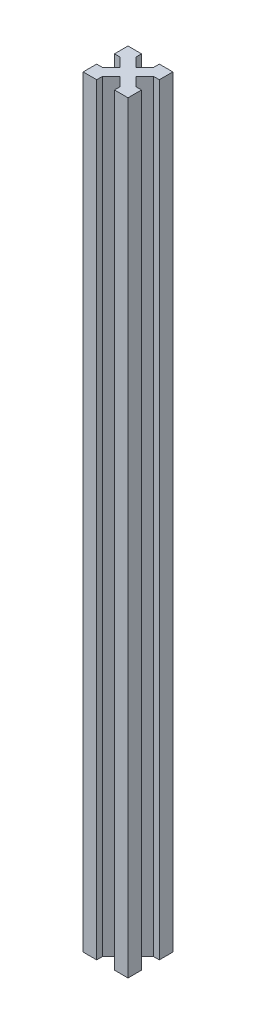
ISO-10303-21;
HEADER;
FILE_DESCRIPTION(('STEP AP214'),'2;1');
FILE_NAME('part.step','',(''),(''),'','','');
FILE_SCHEMA(('AUTOMOTIVE_DESIGN { 1 0 10303 214 1 1 1 1 }'));
ENDSEC;
DATA;
#1=APPLICATION_CONTEXT('core data for automotive mechanical design processes');
#2=APPLICATION_PROTOCOL_DEFINITION('international standard','automotive_design',2000,#1);
#3=PRODUCT_CONTEXT('',#1,'mechanical');
#4=PRODUCT('Part','Part','',(#3));
#5=PRODUCT_RELATED_PRODUCT_CATEGORY('part','',(#4));
#6=PRODUCT_DEFINITION_FORMATION('','',#4);
#7=PRODUCT_DEFINITION_CONTEXT('part definition',#1,'design');
#8=PRODUCT_DEFINITION('design','',#6,#7);
#9=PRODUCT_DEFINITION_SHAPE('','',#8);
#10=(LENGTH_UNIT() NAMED_UNIT(*) SI_UNIT(.MILLI.,.METRE.));
#11=(NAMED_UNIT(*) PLANE_ANGLE_UNIT() SI_UNIT($,.RADIAN.));
#12=(NAMED_UNIT(*) SI_UNIT($,.STERADIAN.) SOLID_ANGLE_UNIT());
#13=UNCERTAINTY_MEASURE_WITH_UNIT(LENGTH_MEASURE(1.E-05),#10,'distance_accuracy_value','');
#14=(GEOMETRIC_REPRESENTATION_CONTEXT(3) GLOBAL_UNCERTAINTY_ASSIGNED_CONTEXT((#13)) GLOBAL_UNIT_ASSIGNED_CONTEXT((#10,
#11,#12)) REPRESENTATION_CONTEXT('',''));
#15=CARTESIAN_POINT('',(0.,0.,0.));
#16=DIRECTION('',(0.,0.,1.));
#17=DIRECTION('',(1.,0.,0.));
#18=AXIS2_PLACEMENT_3D('',#15,#16,#17);
#19=CARTESIAN_POINT('',(-11.7677669529664,340.,-11.7677669529664));
#20=DIRECTION('',(0.707106781186548,0.,0.707106781186547));
#21=DIRECTION('',(0.707106781186547,0.,-0.707106781186548));
#22=AXIS2_PLACEMENT_3D('',#19,#20,#21);
#23=PLANE('',#22);
#24=DIRECTION('',(-0.707106781186547,0.,0.707106781186548));
#25=VECTOR('',#24,1.);
#26=CARTESIAN_POINT('',(-11.7677669529664,0.,-11.7677669529664));
#27=LINE('',#26,#25);
#28=CARTESIAN_POINT('',(-13.5355339059327,0.,-10.));
#29=VERTEX_POINT('',#28);
#30=CARTESIAN_POINT('',(-17.5,0.,-6.03553390593274));
#31=VERTEX_POINT('',#30);
#32=EDGE_CURVE('E226',#29,#31,#27,.T.);
#33=ORIENTED_EDGE('',*,*,#32,.T.);
#34=DIRECTION('',(0.,-1.,0.));
#35=VECTOR('',#34,1.);
#36=CARTESIAN_POINT('',(-17.5,340.,-6.03553390593274));
#37=LINE('',#36,#35);
#38=CARTESIAN_POINT('',(-17.5,340.,-6.03553390593274));
#39=VERTEX_POINT('',#38);
#40=EDGE_CURVE('E11',#39,#31,#37,.T.);
#41=ORIENTED_EDGE('',*,*,#40,.F.);
#42=DIRECTION('',(-0.707106781186547,0.,0.707106781186548));
#43=VECTOR('',#42,1.);
#44=CARTESIAN_POINT('',(-11.7677669529664,340.,-11.7677669529664));
#45=LINE('',#44,#43);
#46=CARTESIAN_POINT('',(-13.5355339059327,340.,-10.));
#47=VERTEX_POINT('',#46);
#48=EDGE_CURVE('E289',#47,#39,#45,.T.);
#49=ORIENTED_EDGE('',*,*,#48,.F.);
#50=DIRECTION('',(0.,-1.,0.));
#51=VECTOR('',#50,1.);
#52=CARTESIAN_POINT('',(-13.5355339059327,340.,-10.));
#53=LINE('',#52,#51);
#54=EDGE_CURVE('E222',#47,#29,#53,.T.);
#55=ORIENTED_EDGE('',*,*,#54,.T.);
#56=EDGE_LOOP('',(#33,#41,#49,#55));
#57=FACE_BOUND('',#56,.T.);
#58=ADVANCED_FACE('F36',(#57),#23,.F.);
#59=CARTESIAN_POINT('',(0.,340.,-6.03553390593273));
#60=DIRECTION('',(0.,0.,1.));
#61=DIRECTION('',(1.,0.,0.));
#62=AXIS2_PLACEMENT_3D('',#59,#60,#61);
#63=PLANE('',#62);
#64=DIRECTION('',(-1.,0.,0.));
#65=VECTOR('',#64,1.);
#66=CARTESIAN_POINT('',(0.,0.,-6.03553390593273));
#67=LINE('',#66,#65);
#68=CARTESIAN_POINT('',(-20.,0.,-6.03553390593273));
#69=VERTEX_POINT('',#68);
#70=EDGE_CURVE('E229',#31,#69,#67,.T.);
#71=ORIENTED_EDGE('',*,*,#70,.T.);
#72=DIRECTION('',(0.,-1.,0.));
#73=VECTOR('',#72,1.);
#74=CARTESIAN_POINT('',(-20.,340.,-6.03553390593273));
#75=LINE('',#74,#73);
#76=CARTESIAN_POINT('',(-20.,340.,-6.03553390593273));
#77=VERTEX_POINT('',#76);
#78=EDGE_CURVE('E44',#77,#69,#75,.T.);
#79=ORIENTED_EDGE('',*,*,#78,.F.);
#80=DIRECTION('',(-1.,0.,0.));
#81=VECTOR('',#80,1.);
#82=CARTESIAN_POINT('',(0.,340.,-6.03553390593273));
#83=LINE('',#82,#81);
#84=EDGE_CURVE('E139',#39,#77,#83,.T.);
#85=ORIENTED_EDGE('',*,*,#84,.F.);
#86=ORIENTED_EDGE('',*,*,#40,.T.);
#87=EDGE_LOOP('',(#71,#79,#85,#86));
#88=FACE_BOUND('',#87,.T.);
#89=ADVANCED_FACE('F338',(#88),#63,.F.);
#90=CARTESIAN_POINT('',(-20.,340.,0.));
#91=DIRECTION('',(-1.,0.,0.));
#92=DIRECTION('',(0.,0.,1.));
#93=AXIS2_PLACEMENT_3D('',#90,#91,#92);
#94=PLANE('',#93);
#95=DIRECTION('',(0.,0.,-1.));
#96=VECTOR('',#95,1.);
#97=CARTESIAN_POINT('',(-20.,0.,0.));
#98=LINE('',#97,#96);
#99=CARTESIAN_POINT('',(-20.,0.,0.));
#100=VERTEX_POINT('',#99);
#101=EDGE_CURVE('E232',#100,#69,#98,.T.);
#102=ORIENTED_EDGE('',*,*,#101,.F.);
#103=DIRECTION('',(0.,-1.,0.));
#104=VECTOR('',#103,1.);
#105=CARTESIAN_POINT('',(-20.,340.,0.));
#106=LINE('',#105,#104);
#107=CARTESIAN_POINT('',(-20.,340.,0.));
#108=VERTEX_POINT('',#107);
#109=EDGE_CURVE('E331',#108,#100,#106,.T.);
#110=ORIENTED_EDGE('',*,*,#109,.F.);
#111=DIRECTION('',(0.,0.,-1.));
#112=VECTOR('',#111,1.);
#113=CARTESIAN_POINT('',(-20.,340.,0.));
#114=LINE('',#113,#112);
#115=EDGE_CURVE('E337',#108,#77,#114,.T.);
#116=ORIENTED_EDGE('',*,*,#115,.T.);
#117=ORIENTED_EDGE('',*,*,#78,.T.);
#118=EDGE_LOOP('',(#102,#110,#116,#117));
#119=FACE_BOUND('',#118,.T.);
#120=ADVANCED_FACE('F335',(#119),#94,.T.);
#121=CARTESIAN_POINT('',(0.,340.,0.));
#122=DIRECTION('',(0.,0.,1.));
#123=DIRECTION('',(1.,0.,0.));
#124=AXIS2_PLACEMENT_3D('',#121,#122,#123);
#125=PLANE('',#124);
#126=DIRECTION('',(-1.,0.,0.));
#127=VECTOR('',#126,1.);
#128=CARTESIAN_POINT('',(0.,0.,0.));
#129=LINE('',#128,#127);
#130=CARTESIAN_POINT('',(-13.9644660940673,0.,0.));
#131=VERTEX_POINT('',#130);
#132=EDGE_CURVE('E235',#131,#100,#129,.T.);
#133=ORIENTED_EDGE('',*,*,#132,.F.);
#134=DIRECTION('',(0.,-1.,0.));
#135=VECTOR('',#134,1.);
#136=CARTESIAN_POINT('',(-13.9644660940673,340.,0.));
#137=LINE('',#136,#135);
#138=CARTESIAN_POINT('',(-13.9644660940673,340.,0.));
#139=VERTEX_POINT('',#138);
#140=EDGE_CURVE('E329',#139,#131,#137,.T.);
#141=ORIENTED_EDGE('',*,*,#140,.F.);
#142=DIRECTION('',(-1.,0.,0.));
#143=VECTOR('',#142,1.);
#144=CARTESIAN_POINT('',(0.,340.,0.));
#145=LINE('',#144,#143);
#146=EDGE_CURVE('E349',#139,#108,#145,.T.);
#147=ORIENTED_EDGE('',*,*,#146,.T.);
#148=ORIENTED_EDGE('',*,*,#109,.T.);
#149=EDGE_LOOP('',(#133,#141,#147,#148));
#150=FACE_BOUND('',#149,.T.);
#151=ADVANCED_FACE('F346',(#150),#125,.T.);
#152=CARTESIAN_POINT('',(-13.9644660940673,340.,0.));
#153=DIRECTION('',(1.,0.,0.));
#154=DIRECTION('',(0.,0.,-1.));
#155=AXIS2_PLACEMENT_3D('',#152,#153,#154);
#156=PLANE('',#155);
#157=DIRECTION('',(0.,0.,1.));
#158=VECTOR('',#157,1.);
#159=CARTESIAN_POINT('',(-13.9644660940673,0.,0.));
#160=LINE('',#159,#158);
#161=CARTESIAN_POINT('',(-13.9644660940673,0.,-2.5));
#162=VERTEX_POINT('',#161);
#163=EDGE_CURVE('E238',#162,#131,#160,.T.);
#164=ORIENTED_EDGE('',*,*,#163,.F.);
#165=DIRECTION('',(0.,-1.,0.));
#166=VECTOR('',#165,1.);
#167=CARTESIAN_POINT('',(-13.9644660940673,340.,-2.5));
#168=LINE('',#167,#166);
#169=CARTESIAN_POINT('',(-13.9644660940673,340.,-2.5));
#170=VERTEX_POINT('',#169);
#171=EDGE_CURVE('E327',#170,#162,#168,.T.);
#172=ORIENTED_EDGE('',*,*,#171,.F.);
#173=DIRECTION('',(0.,0.,1.));
#174=VECTOR('',#173,1.);
#175=CARTESIAN_POINT('',(-13.9644660940673,340.,0.));
#176=LINE('',#175,#174);
#177=EDGE_CURVE('E353',#170,#139,#176,.T.);
#178=ORIENTED_EDGE('',*,*,#177,.T.);
#179=ORIENTED_EDGE('',*,*,#140,.T.);
#180=EDGE_LOOP('',(#164,#172,#178,#179));
#181=FACE_BOUND('',#180,.T.);
#182=ADVANCED_FACE('F427',(#181),#156,.T.);
#183=CARTESIAN_POINT('',(-8.23223304703364,340.,-8.23223304703363));
#184=DIRECTION('',(0.707106781186548,0.,0.707106781186547));
#185=DIRECTION('',(0.707106781186547,0.,-0.707106781186548));
#186=AXIS2_PLACEMENT_3D('',#183,#184,#185);
#187=PLANE('',#186);
#188=DIRECTION('',(-0.707106781186547,0.,0.707106781186548));
#189=VECTOR('',#188,1.);
#190=CARTESIAN_POINT('',(-8.23223304703364,0.,-8.23223304703363));
#191=LINE('',#190,#189);
#192=CARTESIAN_POINT('',(-9.99999999999999,0.,-6.46446609406727));
#193=VERTEX_POINT('',#192);
#194=EDGE_CURVE('E241',#193,#162,#191,.T.);
#195=ORIENTED_EDGE('',*,*,#194,.F.);
#196=DIRECTION('',(0.,-1.,0.));
#197=VECTOR('',#196,1.);
#198=CARTESIAN_POINT('',(-9.99999999999999,340.,-6.46446609406727));
#199=LINE('',#198,#197);
#200=CARTESIAN_POINT('',(-9.99999999999999,340.,-6.46446609406727));
#201=VERTEX_POINT('',#200);
#202=EDGE_CURVE('E325',#201,#193,#199,.T.);
#203=ORIENTED_EDGE('',*,*,#202,.F.);
#204=DIRECTION('',(-0.707106781186547,0.,0.707106781186548));
#205=VECTOR('',#204,1.);
#206=CARTESIAN_POINT('',(-8.23223304703364,340.,-8.23223304703363));
#207=LINE('',#206,#205);
#208=EDGE_CURVE('E359',#201,#170,#207,.T.);
#209=ORIENTED_EDGE('',*,*,#208,.T.);
#210=ORIENTED_EDGE('',*,*,#171,.T.);
#211=EDGE_LOOP('',(#195,#203,#209,#210));
#212=FACE_BOUND('',#211,.T.);
#213=ADVANCED_FACE('F430',(#212),#187,.T.);
#214=CARTESIAN_POINT('',(-1.76776695296636,340.,1.76776695296636));
#215=DIRECTION('',(0.707106781186547,0.,-0.707106781186547));
#216=DIRECTION('',(-0.707106781186548,0.,-0.707106781186548));
#217=AXIS2_PLACEMENT_3D('',#214,#215,#216);
#218=PLANE('',#217);
#219=DIRECTION('',(0.707106781186548,0.,0.707106781186548));
#220=VECTOR('',#219,1.);
#221=CARTESIAN_POINT('',(-1.76776695296636,0.,1.76776695296636));
#222=LINE('',#221,#220);
#223=CARTESIAN_POINT('',(-6.03553390593273,0.,-2.5));
#224=VERTEX_POINT('',#223);
#225=EDGE_CURVE('E244',#193,#224,#222,.T.);
#226=ORIENTED_EDGE('',*,*,#225,.T.);
#227=DIRECTION('',(0.,-1.,0.));
#228=VECTOR('',#227,1.);
#229=CARTESIAN_POINT('',(-6.03553390593273,340.,-2.5));
#230=LINE('',#229,#228);
#231=CARTESIAN_POINT('',(-6.03553390593273,340.,-2.5));
#232=VERTEX_POINT('',#231);
#233=EDGE_CURVE('E322',#232,#224,#230,.T.);
#234=ORIENTED_EDGE('',*,*,#233,.F.);
#235=DIRECTION('',(0.707106781186548,0.,0.707106781186548));
#236=VECTOR('',#235,1.);
#237=CARTESIAN_POINT('',(-1.76776695296636,340.,1.76776695296636));
#238=LINE('',#237,#236);
#239=EDGE_CURVE('E362',#201,#232,#238,.T.);
#240=ORIENTED_EDGE('',*,*,#239,.F.);
#241=ORIENTED_EDGE('',*,*,#202,.T.);
#242=EDGE_LOOP('',(#226,#234,#240,#241));
#243=FACE_BOUND('',#242,.T.);
#244=ADVANCED_FACE('F434',(#243),#218,.F.);
#245=CARTESIAN_POINT('',(-6.03553390593273,340.,0.));
#246=DIRECTION('',(1.,0.,0.));
#247=DIRECTION('',(0.,0.,-1.));
#248=AXIS2_PLACEMENT_3D('',#245,#246,#247);
#249=PLANE('',#248);
#250=DIRECTION('',(0.,0.,1.));
#251=VECTOR('',#250,1.);
#252=CARTESIAN_POINT('',(-6.03553390593273,0.,0.));
#253=LINE('',#252,#251);
#254=CARTESIAN_POINT('',(-6.03553390593273,0.,0.));
#255=VERTEX_POINT('',#254);
#256=EDGE_CURVE('E246',#224,#255,#253,.T.);
#257=ORIENTED_EDGE('',*,*,#256,.T.);
#258=DIRECTION('',(0.,-1.,0.));
#259=VECTOR('',#258,1.);
#260=CARTESIAN_POINT('',(-6.03553390593273,340.,0.));
#261=LINE('',#260,#259);
#262=CARTESIAN_POINT('',(-6.03553390593273,340.,0.));
#263=VERTEX_POINT('',#262);
#264=EDGE_CURVE('E320',#263,#255,#261,.T.);
#265=ORIENTED_EDGE('',*,*,#264,.F.);
#266=DIRECTION('',(0.,0.,1.));
#267=VECTOR('',#266,1.);
#268=CARTESIAN_POINT('',(-6.03553390593273,340.,0.));
#269=LINE('',#268,#267);
#270=EDGE_CURVE('E364',#232,#263,#269,.T.);
#271=ORIENTED_EDGE('',*,*,#270,.F.);
#272=ORIENTED_EDGE('',*,*,#233,.T.);
#273=EDGE_LOOP('',(#257,#265,#271,#272));
#274=FACE_BOUND('',#273,.T.);
#275=ADVANCED_FACE('F438',(#274),#249,.F.);
#276=CARTESIAN_POINT('',(0.,340.,0.));
#277=DIRECTION('',(0.,0.,1.));
#278=DIRECTION('',(1.,0.,0.));
#279=AXIS2_PLACEMENT_3D('',#276,#277,#278);
#280=PLANE('',#279);
#281=DIRECTION('',(-1.,0.,0.));
#282=VECTOR('',#281,1.);
#283=CARTESIAN_POINT('',(0.,0.,0.));
#284=LINE('',#283,#282);
#285=CARTESIAN_POINT('',(0.,0.,0.));
#286=VERTEX_POINT('',#285);
#287=EDGE_CURVE('E249',#286,#255,#284,.T.);
#288=ORIENTED_EDGE('',*,*,#287,.F.);
#289=DIRECTION('',(0.,-1.,0.));
#290=VECTOR('',#289,1.);
#291=CARTESIAN_POINT('',(0.,340.,0.));
#292=LINE('',#291,#290);
#293=CARTESIAN_POINT('',(0.,340.,0.));
#294=VERTEX_POINT('',#293);
#295=EDGE_CURVE('E318',#294,#286,#292,.T.);
#296=ORIENTED_EDGE('',*,*,#295,.F.);
#297=DIRECTION('',(-1.,0.,0.));
#298=VECTOR('',#297,1.);
#299=CARTESIAN_POINT('',(0.,340.,0.));
#300=LINE('',#299,#298);
#301=EDGE_CURVE('E366',#294,#263,#300,.T.);
#302=ORIENTED_EDGE('',*,*,#301,.T.);
#303=ORIENTED_EDGE('',*,*,#264,.T.);
#304=EDGE_LOOP('',(#288,#296,#302,#303));
#305=FACE_BOUND('',#304,.T.);
#306=ADVANCED_FACE('F442',(#305),#280,.T.);
#307=CARTESIAN_POINT('',(0.,340.,0.));
#308=DIRECTION('',(-1.,0.,0.));
#309=DIRECTION('',(0.,0.,1.));
#310=AXIS2_PLACEMENT_3D('',#307,#308,#309);
#311=PLANE('',#310);
#312=DIRECTION('',(0.,0.,-1.));
#313=VECTOR('',#312,1.);
#314=CARTESIAN_POINT('',(0.,0.,0.));
#315=LINE('',#314,#313);
#316=CARTESIAN_POINT('',(0.,0.,-6.03553390593273));
#317=VERTEX_POINT('',#316);
#318=EDGE_CURVE('E252',#286,#317,#315,.T.);
#319=ORIENTED_EDGE('',*,*,#318,.T.);
#320=DIRECTION('',(0.,-1.,0.));
#321=VECTOR('',#320,1.);
#322=CARTESIAN_POINT('',(0.,340.,-6.03553390593273));
#323=LINE('',#322,#321);
#324=CARTESIAN_POINT('',(0.,340.,-6.03553390593273));
#325=VERTEX_POINT('',#324);
#326=EDGE_CURVE('E316',#325,#317,#323,.T.);
#327=ORIENTED_EDGE('',*,*,#326,.F.);
#328=DIRECTION('',(0.,0.,-1.));
#329=VECTOR('',#328,1.);
#330=CARTESIAN_POINT('',(0.,340.,0.));
#331=LINE('',#330,#329);
#332=EDGE_CURVE('E369',#294,#325,#331,.T.);
#333=ORIENTED_EDGE('',*,*,#332,.F.);
#334=ORIENTED_EDGE('',*,*,#295,.T.);
#335=EDGE_LOOP('',(#319,#327,#333,#334));
#336=FACE_BOUND('',#335,.T.);
#337=ADVANCED_FACE('F446',(#336),#311,.F.);
#338=CARTESIAN_POINT('',(0.,340.,-6.03553390593273));
#339=DIRECTION('',(0.,0.,-1.));
#340=DIRECTION('',(-1.,0.,0.));
#341=AXIS2_PLACEMENT_3D('',#338,#339,#340);
#342=PLANE('',#341);
#343=DIRECTION('',(1.,0.,0.));
#344=VECTOR('',#343,1.);
#345=CARTESIAN_POINT('',(0.,0.,-6.03553390593273));
#346=LINE('',#345,#344);
#347=CARTESIAN_POINT('',(-2.5,0.,-6.03553390593274));
#348=VERTEX_POINT('',#347);
#349=EDGE_CURVE('E255',#348,#317,#346,.T.);
#350=ORIENTED_EDGE('',*,*,#349,.F.);
#351=DIRECTION('',(0.,-1.,0.));
#352=VECTOR('',#351,1.);
#353=CARTESIAN_POINT('',(-2.5,340.,-6.03553390593274));
#354=LINE('',#353,#352);
#355=CARTESIAN_POINT('',(-2.5,340.,-6.03553390593274));
#356=VERTEX_POINT('',#355);
#357=EDGE_CURVE('E314',#356,#348,#354,.T.);
#358=ORIENTED_EDGE('',*,*,#357,.F.);
#359=DIRECTION('',(1.,0.,0.));
#360=VECTOR('',#359,1.);
#361=CARTESIAN_POINT('',(0.,340.,-6.03553390593273));
#362=LINE('',#361,#360);
#363=EDGE_CURVE('E371',#356,#325,#362,.T.);
#364=ORIENTED_EDGE('',*,*,#363,.T.);
#365=ORIENTED_EDGE('',*,*,#326,.T.);
#366=EDGE_LOOP('',(#350,#358,#364,#365));
#367=FACE_BOUND('',#366,.T.);
#368=ADVANCED_FACE('F450',(#367),#342,.T.);
#369=CARTESIAN_POINT('',(1.76776695296637,340.,-1.76776695296637));
#370=DIRECTION('',(0.707106781186547,0.,-0.707106781186547));
#371=DIRECTION('',(-0.707106781186548,0.,-0.707106781186548));
#372=AXIS2_PLACEMENT_3D('',#369,#370,#371);
#373=PLANE('',#372);
#374=DIRECTION('',(0.707106781186548,0.,0.707106781186548));
#375=VECTOR('',#374,1.);
#376=CARTESIAN_POINT('',(1.76776695296637,0.,-1.76776695296637));
#377=LINE('',#376,#375);
#378=CARTESIAN_POINT('',(-6.46446609406727,0.,-10.));
#379=VERTEX_POINT('',#378);
#380=EDGE_CURVE('E258',#379,#348,#377,.T.);
#381=ORIENTED_EDGE('',*,*,#380,.F.);
#382=DIRECTION('',(0.,-1.,0.));
#383=VECTOR('',#382,1.);
#384=CARTESIAN_POINT('',(-6.46446609406727,340.,-10.));
#385=LINE('',#384,#383);
#386=CARTESIAN_POINT('',(-6.46446609406727,340.,-10.));
#387=VERTEX_POINT('',#386);
#388=EDGE_CURVE('E312',#387,#379,#385,.T.);
#389=ORIENTED_EDGE('',*,*,#388,.F.);
#390=DIRECTION('',(0.707106781186548,0.,0.707106781186548));
#391=VECTOR('',#390,1.);
#392=CARTESIAN_POINT('',(1.76776695296637,340.,-1.76776695296637));
#393=LINE('',#392,#391);
#394=EDGE_CURVE('E374',#387,#356,#393,.T.);
#395=ORIENTED_EDGE('',*,*,#394,.T.);
#396=ORIENTED_EDGE('',*,*,#357,.T.);
#397=EDGE_LOOP('',(#381,#389,#395,#396));
#398=FACE_BOUND('',#397,.T.);
#399=ADVANCED_FACE('F454',(#398),#373,.T.);
#400=CARTESIAN_POINT('',(-8.23223304703364,340.,-8.23223304703363));
#401=DIRECTION('',(0.707106781186548,0.,0.707106781186547));
#402=DIRECTION('',(0.707106781186547,0.,-0.707106781186548));
#403=AXIS2_PLACEMENT_3D('',#400,#401,#402);
#404=PLANE('',#403);
#405=DIRECTION('',(-0.707106781186547,0.,0.707106781186548));
#406=VECTOR('',#405,1.);
#407=CARTESIAN_POINT('',(-8.23223304703364,0.,-8.23223304703363));
#408=LINE('',#407,#406);
#409=CARTESIAN_POINT('',(-2.50000000000001,0.,-13.9644660940673));
#410=VERTEX_POINT('',#409);
#411=EDGE_CURVE('E261',#410,#379,#408,.T.);
#412=ORIENTED_EDGE('',*,*,#411,.F.);
#413=DIRECTION('',(0.,-1.,0.));
#414=VECTOR('',#413,1.);
#415=CARTESIAN_POINT('',(-2.50000000000001,340.,-13.9644660940673));
#416=LINE('',#415,#414);
#417=CARTESIAN_POINT('',(-2.50000000000001,340.,-13.9644660940673));
#418=VERTEX_POINT('',#417);
#419=EDGE_CURVE('E310',#418,#410,#416,.T.);
#420=ORIENTED_EDGE('',*,*,#419,.F.);
#421=DIRECTION('',(-0.707106781186547,0.,0.707106781186548));
#422=VECTOR('',#421,1.);
#423=CARTESIAN_POINT('',(-8.23223304703364,340.,-8.23223304703363));
#424=LINE('',#423,#422);
#425=EDGE_CURVE('E377',#418,#387,#424,.T.);
#426=ORIENTED_EDGE('',*,*,#425,.T.);
#427=ORIENTED_EDGE('',*,*,#388,.T.);
#428=EDGE_LOOP('',(#412,#420,#426,#427));
#429=FACE_BOUND('',#428,.T.);
#430=ADVANCED_FACE('F458',(#429),#404,.T.);
#431=CARTESIAN_POINT('',(0.,340.,-13.9644660940673));
#432=DIRECTION('',(0.,0.,-1.));
#433=DIRECTION('',(-1.,0.,0.));
#434=AXIS2_PLACEMENT_3D('',#431,#432,#433);
#435=PLANE('',#434);
#436=DIRECTION('',(1.,0.,0.));
#437=VECTOR('',#436,1.);
#438=CARTESIAN_POINT('',(0.,0.,-13.9644660940673));
#439=LINE('',#438,#437);
#440=CARTESIAN_POINT('',(0.,0.,-13.9644660940673));
#441=VERTEX_POINT('',#440);
#442=EDGE_CURVE('E264',#410,#441,#439,.T.);
#443=ORIENTED_EDGE('',*,*,#442,.T.);
#444=DIRECTION('',(0.,-1.,0.));
#445=VECTOR('',#444,1.);
#446=CARTESIAN_POINT('',(0.,340.,-13.9644660940673));
#447=LINE('',#446,#445);
#448=CARTESIAN_POINT('',(0.,340.,-13.9644660940673));
#449=VERTEX_POINT('',#448);
#450=EDGE_CURVE('E307',#449,#441,#447,.T.);
#451=ORIENTED_EDGE('',*,*,#450,.F.);
#452=DIRECTION('',(1.,0.,0.));
#453=VECTOR('',#452,1.);
#454=CARTESIAN_POINT('',(0.,340.,-13.9644660940673));
#455=LINE('',#454,#453);
#456=EDGE_CURVE('E380',#418,#449,#455,.T.);
#457=ORIENTED_EDGE('',*,*,#456,.F.);
#458=ORIENTED_EDGE('',*,*,#419,.T.);
#459=EDGE_LOOP('',(#443,#451,#457,#458));
#460=FACE_BOUND('',#459,.T.);
#461=ADVANCED_FACE('F462',(#460),#435,.F.);
#462=CARTESIAN_POINT('',(0.,340.,0.));
#463=DIRECTION('',(-1.,0.,0.));
#464=DIRECTION('',(0.,0.,1.));
#465=AXIS2_PLACEMENT_3D('',#462,#463,#464);
#466=PLANE('',#465);
#467=DIRECTION('',(0.,0.,-1.));
#468=VECTOR('',#467,1.);
#469=CARTESIAN_POINT('',(0.,0.,0.));
#470=LINE('',#469,#468);
#471=CARTESIAN_POINT('',(0.,0.,-20.));
#472=VERTEX_POINT('',#471);
#473=EDGE_CURVE('E266',#441,#472,#470,.T.);
#474=ORIENTED_EDGE('',*,*,#473,.T.);
#475=DIRECTION('',(0.,-1.,0.));
#476=VECTOR('',#475,1.);
#477=CARTESIAN_POINT('',(0.,340.,-20.));
#478=LINE('',#477,#476);
#479=CARTESIAN_POINT('',(0.,340.,-20.));
#480=VERTEX_POINT('',#479);
#481=EDGE_CURVE('E304',#480,#472,#478,.T.);
#482=ORIENTED_EDGE('',*,*,#481,.F.);
#483=DIRECTION('',(0.,0.,-1.));
#484=VECTOR('',#483,1.);
#485=CARTESIAN_POINT('',(0.,340.,0.));
#486=LINE('',#485,#484);
#487=EDGE_CURVE('E382',#449,#480,#486,.T.);
#488=ORIENTED_EDGE('',*,*,#487,.F.);
#489=ORIENTED_EDGE('',*,*,#450,.T.);
#490=EDGE_LOOP('',(#474,#482,#488,#489));
#491=FACE_BOUND('',#490,.T.);
#492=ADVANCED_FACE('F466',(#491),#466,.F.);
#493=CARTESIAN_POINT('',(0.,340.,-20.));
#494=DIRECTION('',(0.,0.,1.));
#495=DIRECTION('',(1.,0.,0.));
#496=AXIS2_PLACEMENT_3D('',#493,#494,#495);
#497=PLANE('',#496);
#498=DIRECTION('',(-1.,0.,0.));
#499=VECTOR('',#498,1.);
#500=CARTESIAN_POINT('',(0.,0.,-20.));
#501=LINE('',#500,#499);
#502=CARTESIAN_POINT('',(-6.03553390593273,0.,-20.));
#503=VERTEX_POINT('',#502);
#504=EDGE_CURVE('E268',#472,#503,#501,.T.);
#505=ORIENTED_EDGE('',*,*,#504,.T.);
#506=DIRECTION('',(0.,-1.,0.));
#507=VECTOR('',#506,1.);
#508=CARTESIAN_POINT('',(-6.03553390593273,340.,-20.));
#509=LINE('',#508,#507);
#510=CARTESIAN_POINT('',(-6.03553390593273,340.,-20.));
#511=VERTEX_POINT('',#510);
#512=EDGE_CURVE('E302',#511,#503,#509,.T.);
#513=ORIENTED_EDGE('',*,*,#512,.F.);
#514=DIRECTION('',(-1.,0.,0.));
#515=VECTOR('',#514,1.);
#516=CARTESIAN_POINT('',(0.,340.,-20.));
#517=LINE('',#516,#515);
#518=EDGE_CURVE('E384',#480,#511,#517,.T.);
#519=ORIENTED_EDGE('',*,*,#518,.F.);
#520=ORIENTED_EDGE('',*,*,#481,.T.);
#521=EDGE_LOOP('',(#505,#513,#519,#520));
#522=FACE_BOUND('',#521,.T.);
#523=ADVANCED_FACE('F470',(#522),#497,.F.);
#524=CARTESIAN_POINT('',(-6.03553390593271,340.,0.));
#525=DIRECTION('',(-1.,0.,0.));
#526=DIRECTION('',(0.,0.,1.));
#527=AXIS2_PLACEMENT_3D('',#524,#525,#526);
#528=PLANE('',#527);
#529=DIRECTION('',(0.,0.,-1.));
#530=VECTOR('',#529,1.);
#531=CARTESIAN_POINT('',(-6.03553390593271,0.,0.));
#532=LINE('',#531,#530);
#533=CARTESIAN_POINT('',(-6.03553390593274,0.,-17.5));
#534=VERTEX_POINT('',#533);
#535=EDGE_CURVE('E271',#534,#503,#532,.T.);
#536=ORIENTED_EDGE('',*,*,#535,.F.);
#537=DIRECTION('',(0.,-1.,0.));
#538=VECTOR('',#537,1.);
#539=CARTESIAN_POINT('',(-6.03553390593274,340.,-17.5));
#540=LINE('',#539,#538);
#541=CARTESIAN_POINT('',(-6.03553390593274,340.,-17.5));
#542=VERTEX_POINT('',#541);
#543=EDGE_CURVE('E300',#542,#534,#540,.T.);
#544=ORIENTED_EDGE('',*,*,#543,.F.);
#545=DIRECTION('',(0.,0.,-1.));
#546=VECTOR('',#545,1.);
#547=CARTESIAN_POINT('',(-6.03553390593271,340.,0.));
#548=LINE('',#547,#546);
#549=EDGE_CURVE('E386',#542,#511,#548,.T.);
#550=ORIENTED_EDGE('',*,*,#549,.T.);
#551=ORIENTED_EDGE('',*,*,#512,.T.);
#552=EDGE_LOOP('',(#536,#544,#550,#551));
#553=FACE_BOUND('',#552,.T.);
#554=ADVANCED_FACE('F474',(#553),#528,.T.);
#555=CARTESIAN_POINT('',(-11.7677669529664,340.,-11.7677669529664));
#556=DIRECTION('',(0.707106781186548,0.,0.707106781186547));
#557=DIRECTION('',(0.707106781186547,0.,-0.707106781186548));
#558=AXIS2_PLACEMENT_3D('',#555,#556,#557);
#559=PLANE('',#558);
#560=DIRECTION('',(-0.707106781186547,0.,0.707106781186548));
#561=VECTOR('',#560,1.);
#562=CARTESIAN_POINT('',(-11.7677669529664,0.,-11.7677669529664));
#563=LINE('',#562,#561);
#564=CARTESIAN_POINT('',(-10.,0.,-13.5355339059327));
#565=VERTEX_POINT('',#564);
#566=EDGE_CURVE('E274',#534,#565,#563,.T.);
#567=ORIENTED_EDGE('',*,*,#566,.T.);
#568=DIRECTION('',(0.,-1.,0.));
#569=VECTOR('',#568,1.);
#570=CARTESIAN_POINT('',(-10.,340.,-13.5355339059327));
#571=LINE('',#570,#569);
#572=CARTESIAN_POINT('',(-10.,340.,-13.5355339059327));
#573=VERTEX_POINT('',#572);
#574=EDGE_CURVE('E298',#573,#565,#571,.T.);
#575=ORIENTED_EDGE('',*,*,#574,.F.);
#576=DIRECTION('',(-0.707106781186547,0.,0.707106781186548));
#577=VECTOR('',#576,1.);
#578=CARTESIAN_POINT('',(-11.7677669529664,340.,-11.7677669529664));
#579=LINE('',#578,#577);
#580=EDGE_CURVE('E389',#542,#573,#579,.T.);
#581=ORIENTED_EDGE('',*,*,#580,.F.);
#582=ORIENTED_EDGE('',*,*,#543,.T.);
#583=EDGE_LOOP('',(#567,#575,#581,#582));
#584=FACE_BOUND('',#583,.T.);
#585=ADVANCED_FACE('F478',(#584),#559,.F.);
#586=CARTESIAN_POINT('',(1.76776695296637,340.,-1.76776695296637));
#587=DIRECTION('',(0.707106781186547,0.,-0.707106781186547));
#588=DIRECTION('',(-0.707106781186548,0.,-0.707106781186548));
#589=AXIS2_PLACEMENT_3D('',#586,#587,#588);
#590=PLANE('',#589);
#591=DIRECTION('',(0.707106781186548,0.,0.707106781186548));
#592=VECTOR('',#591,1.);
#593=CARTESIAN_POINT('',(1.76776695296637,0.,-1.76776695296637));
#594=LINE('',#593,#592);
#595=CARTESIAN_POINT('',(-13.9644660940673,0.,-17.5));
#596=VERTEX_POINT('',#595);
#597=EDGE_CURVE('E277',#596,#565,#594,.T.);
#598=ORIENTED_EDGE('',*,*,#597,.F.);
#599=DIRECTION('',(0.,-1.,0.));
#600=VECTOR('',#599,1.);
#601=CARTESIAN_POINT('',(-13.9644660940673,340.,-17.5));
#602=LINE('',#601,#600);
#603=CARTESIAN_POINT('',(-13.9644660940673,340.,-17.5));
#604=VERTEX_POINT('',#603);
#605=EDGE_CURVE('E296',#604,#596,#602,.T.);
#606=ORIENTED_EDGE('',*,*,#605,.F.);
#607=DIRECTION('',(0.707106781186548,0.,0.707106781186548));
#608=VECTOR('',#607,1.);
#609=CARTESIAN_POINT('',(1.76776695296637,340.,-1.76776695296637));
#610=LINE('',#609,#608);
#611=EDGE_CURVE('E391',#604,#573,#610,.T.);
#612=ORIENTED_EDGE('',*,*,#611,.T.);
#613=ORIENTED_EDGE('',*,*,#574,.T.);
#614=EDGE_LOOP('',(#598,#606,#612,#613));
#615=FACE_BOUND('',#614,.T.);
#616=ADVANCED_FACE('F482',(#615),#590,.T.);
#617=CARTESIAN_POINT('',(-13.9644660940673,340.,0.));
#618=DIRECTION('',(-1.,0.,0.));
#619=DIRECTION('',(0.,0.,1.));
#620=AXIS2_PLACEMENT_3D('',#617,#618,#619);
#621=PLANE('',#620);
#622=DIRECTION('',(0.,0.,-1.));
#623=VECTOR('',#622,1.);
#624=CARTESIAN_POINT('',(-13.9644660940673,0.,0.));
#625=LINE('',#624,#623);
#626=CARTESIAN_POINT('',(-13.9644660940673,0.,-20.));
#627=VERTEX_POINT('',#626);
#628=EDGE_CURVE('E280',#596,#627,#625,.T.);
#629=ORIENTED_EDGE('',*,*,#628,.T.);
#630=DIRECTION('',(0.,-1.,0.));
#631=VECTOR('',#630,1.);
#632=CARTESIAN_POINT('',(-13.9644660940673,340.,-20.));
#633=LINE('',#632,#631);
#634=CARTESIAN_POINT('',(-13.9644660940673,340.,-20.));
#635=VERTEX_POINT('',#634);
#636=EDGE_CURVE('E293',#635,#627,#633,.T.);
#637=ORIENTED_EDGE('',*,*,#636,.F.);
#638=DIRECTION('',(0.,0.,-1.));
#639=VECTOR('',#638,1.);
#640=CARTESIAN_POINT('',(-13.9644660940673,340.,0.));
#641=LINE('',#640,#639);
#642=EDGE_CURVE('E394',#604,#635,#641,.T.);
#643=ORIENTED_EDGE('',*,*,#642,.F.);
#644=ORIENTED_EDGE('',*,*,#605,.T.);
#645=EDGE_LOOP('',(#629,#637,#643,#644));
#646=FACE_BOUND('',#645,.T.);
#647=ADVANCED_FACE('F399',(#646),#621,.F.);
#648=CARTESIAN_POINT('',(0.,340.,-20.));
#649=DIRECTION('',(0.,0.,1.));
#650=DIRECTION('',(1.,0.,0.));
#651=AXIS2_PLACEMENT_3D('',#648,#649,#650);
#652=PLANE('',#651);
#653=DIRECTION('',(-1.,0.,0.));
#654=VECTOR('',#653,1.);
#655=CARTESIAN_POINT('',(0.,0.,-20.));
#656=LINE('',#655,#654);
#657=CARTESIAN_POINT('',(-20.,0.,-20.));
#658=VERTEX_POINT('',#657);
#659=EDGE_CURVE('E282',#627,#658,#656,.T.);
#660=ORIENTED_EDGE('',*,*,#659,.T.);
#661=DIRECTION('',(0.,-1.,0.));
#662=VECTOR('',#661,1.);
#663=CARTESIAN_POINT('',(-20.,340.,-20.));
#664=LINE('',#663,#662);
#665=CARTESIAN_POINT('',(-20.,340.,-20.));
#666=VERTEX_POINT('',#665);
#667=EDGE_CURVE('E212',#666,#658,#664,.T.);
#668=ORIENTED_EDGE('',*,*,#667,.F.);
#669=DIRECTION('',(-1.,0.,0.));
#670=VECTOR('',#669,1.);
#671=CARTESIAN_POINT('',(0.,340.,-20.));
#672=LINE('',#671,#670);
#673=EDGE_CURVE('E217',#635,#666,#672,.T.);
#674=ORIENTED_EDGE('',*,*,#673,.F.);
#675=ORIENTED_EDGE('',*,*,#636,.T.);
#676=EDGE_LOOP('',(#660,#668,#674,#675));
#677=FACE_BOUND('',#676,.T.);
#678=ADVANCED_FACE('F403',(#677),#652,.F.);
#679=CARTESIAN_POINT('',(-20.,340.,0.));
#680=DIRECTION('',(-1.,0.,0.));
#681=DIRECTION('',(0.,0.,1.));
#682=AXIS2_PLACEMENT_3D('',#679,#680,#681);
#683=PLANE('',#682);
#684=DIRECTION('',(0.,0.,-1.));
#685=VECTOR('',#684,1.);
#686=CARTESIAN_POINT('',(-20.,0.,0.));
#687=LINE('',#686,#685);
#688=CARTESIAN_POINT('',(-20.,0.,-13.9644660940673));
#689=VERTEX_POINT('',#688);
#690=EDGE_CURVE('E207',#689,#658,#687,.T.);
#691=ORIENTED_EDGE('',*,*,#690,.F.);
#692=DIRECTION('',(0.,-1.,0.));
#693=VECTOR('',#692,1.);
#694=CARTESIAN_POINT('',(-20.,340.,-13.9644660940673));
#695=LINE('',#694,#693);
#696=CARTESIAN_POINT('',(-20.,340.,-13.9644660940673));
#697=VERTEX_POINT('',#696);
#698=EDGE_CURVE('E202',#697,#689,#695,.T.);
#699=ORIENTED_EDGE('',*,*,#698,.F.);
#700=DIRECTION('',(0.,0.,-1.));
#701=VECTOR('',#700,1.);
#702=CARTESIAN_POINT('',(-20.,340.,0.));
#703=LINE('',#702,#701);
#704=EDGE_CURVE('E205',#697,#666,#703,.T.);
#705=ORIENTED_EDGE('',*,*,#704,.T.);
#706=ORIENTED_EDGE('',*,*,#667,.T.);
#707=EDGE_LOOP('',(#691,#699,#705,#706));
#708=FACE_BOUND('',#707,.T.);
#709=ADVANCED_FACE('F204',(#708),#683,.T.);
#710=CARTESIAN_POINT('',(0.,340.,-13.9644660940673));
#711=DIRECTION('',(0.,0.,1.));
#712=DIRECTION('',(1.,0.,0.));
#713=AXIS2_PLACEMENT_3D('',#710,#711,#712);
#714=PLANE('',#713);
#715=DIRECTION('',(-1.,0.,0.));
#716=VECTOR('',#715,1.);
#717=CARTESIAN_POINT('',(0.,0.,-13.9644660940673));
#718=LINE('',#717,#716);
#719=CARTESIAN_POINT('',(-17.5,0.,-13.9644660940673));
#720=VERTEX_POINT('',#719);
#721=EDGE_CURVE('E286',#720,#689,#718,.T.);
#722=ORIENTED_EDGE('',*,*,#721,.F.);
#723=DIRECTION('',(0.,-1.,0.));
#724=VECTOR('',#723,1.);
#725=CARTESIAN_POINT('',(-17.5,340.,-13.9644660940673));
#726=LINE('',#725,#724);
#727=CARTESIAN_POINT('',(-17.5,340.,-13.9644660940673));
#728=VERTEX_POINT('',#727);
#729=EDGE_CURVE('E128',#728,#720,#726,.T.);
#730=ORIENTED_EDGE('',*,*,#729,.F.);
#731=DIRECTION('',(-1.,0.,0.));
#732=VECTOR('',#731,1.);
#733=CARTESIAN_POINT('',(0.,340.,-13.9644660940673));
#734=LINE('',#733,#732);
#735=EDGE_CURVE('E215',#728,#697,#734,.T.);
#736=ORIENTED_EDGE('',*,*,#735,.T.);
#737=ORIENTED_EDGE('',*,*,#698,.T.);
#738=EDGE_LOOP('',(#722,#730,#736,#737));
#739=FACE_BOUND('',#738,.T.);
#740=ADVANCED_FACE('F220',(#739),#714,.T.);
#741=CARTESIAN_POINT('',(-1.76776695296636,340.,1.76776695296636));
#742=DIRECTION('',(0.707106781186547,0.,-0.707106781186547));
#743=DIRECTION('',(-0.707106781186548,0.,-0.707106781186548));
#744=AXIS2_PLACEMENT_3D('',#741,#742,#743);
#745=PLANE('',#744);
#746=DIRECTION('',(0.707106781186548,0.,0.707106781186548));
#747=VECTOR('',#746,1.);
#748=CARTESIAN_POINT('',(-1.76776695296636,0.,1.76776695296636));
#749=LINE('',#748,#747);
#750=EDGE_CURVE('E131',#720,#29,#749,.T.);
#751=ORIENTED_EDGE('',*,*,#750,.T.);
#752=ORIENTED_EDGE('',*,*,#54,.F.);
#753=DIRECTION('',(0.707106781186548,0.,0.707106781186548));
#754=VECTOR('',#753,1.);
#755=CARTESIAN_POINT('',(-1.76776695296636,340.,1.76776695296636));
#756=LINE('',#755,#754);
#757=EDGE_CURVE('E52',#728,#47,#756,.T.);
#758=ORIENTED_EDGE('',*,*,#757,.F.);
#759=ORIENTED_EDGE('',*,*,#729,.T.);
#760=EDGE_LOOP('',(#751,#752,#758,#759));
#761=FACE_BOUND('',#760,.T.);
#762=ADVANCED_FACE('F406',(#761),#745,.F.);
#763=CARTESIAN_POINT('',(0.,340.,0.));
#764=DIRECTION('',(0.,1.,0.));
#765=DIRECTION('',(0.,0.,1.));
#766=AXIS2_PLACEMENT_3D('',#763,#764,#765);
#767=PLANE('',#766);
#768=ORIENTED_EDGE('',*,*,#48,.T.);
#769=ORIENTED_EDGE('',*,*,#84,.T.);
#770=ORIENTED_EDGE('',*,*,#115,.F.);
#771=ORIENTED_EDGE('',*,*,#146,.F.);
#772=ORIENTED_EDGE('',*,*,#177,.F.);
#773=ORIENTED_EDGE('',*,*,#208,.F.);
#774=ORIENTED_EDGE('',*,*,#239,.T.);
#775=ORIENTED_EDGE('',*,*,#270,.T.);
#776=ORIENTED_EDGE('',*,*,#301,.F.);
#777=ORIENTED_EDGE('',*,*,#332,.T.);
#778=ORIENTED_EDGE('',*,*,#363,.F.);
#779=ORIENTED_EDGE('',*,*,#394,.F.);
#780=ORIENTED_EDGE('',*,*,#425,.F.);
#781=ORIENTED_EDGE('',*,*,#456,.T.);
#782=ORIENTED_EDGE('',*,*,#487,.T.);
#783=ORIENTED_EDGE('',*,*,#518,.T.);
#784=ORIENTED_EDGE('',*,*,#549,.F.);
#785=ORIENTED_EDGE('',*,*,#580,.T.);
#786=ORIENTED_EDGE('',*,*,#611,.F.);
#787=ORIENTED_EDGE('',*,*,#642,.T.);
#788=ORIENTED_EDGE('',*,*,#673,.T.);
#789=ORIENTED_EDGE('',*,*,#704,.F.);
#790=ORIENTED_EDGE('',*,*,#735,.F.);
#791=ORIENTED_EDGE('',*,*,#757,.T.);
#792=EDGE_LOOP('',(#768,#769,#770,#771,#772,#773,#774,#775,#776,#777,#778,#779,#780,#781,#782,
#783,#784,#785,#786,#787,#788,#789,#790,#791));
#793=FACE_BOUND('',#792,.T.);
#794=ADVANCED_FACE('F214',(#793),#767,.T.);
#795=CARTESIAN_POINT('',(0.,0.,0.));
#796=DIRECTION('',(0.,1.,0.));
#797=DIRECTION('',(0.,0.,1.));
#798=AXIS2_PLACEMENT_3D('',#795,#796,#797);
#799=PLANE('',#798);
#800=ORIENTED_EDGE('',*,*,#32,.F.);
#801=ORIENTED_EDGE('',*,*,#750,.F.);
#802=ORIENTED_EDGE('',*,*,#721,.T.);
#803=ORIENTED_EDGE('',*,*,#690,.T.);
#804=ORIENTED_EDGE('',*,*,#659,.F.);
#805=ORIENTED_EDGE('',*,*,#628,.F.);
#806=ORIENTED_EDGE('',*,*,#597,.T.);
#807=ORIENTED_EDGE('',*,*,#566,.F.);
#808=ORIENTED_EDGE('',*,*,#535,.T.);
#809=ORIENTED_EDGE('',*,*,#504,.F.);
#810=ORIENTED_EDGE('',*,*,#473,.F.);
#811=ORIENTED_EDGE('',*,*,#442,.F.);
#812=ORIENTED_EDGE('',*,*,#411,.T.);
#813=ORIENTED_EDGE('',*,*,#380,.T.);
#814=ORIENTED_EDGE('',*,*,#349,.T.);
#815=ORIENTED_EDGE('',*,*,#318,.F.);
#816=ORIENTED_EDGE('',*,*,#287,.T.);
#817=ORIENTED_EDGE('',*,*,#256,.F.);
#818=ORIENTED_EDGE('',*,*,#225,.F.);
#819=ORIENTED_EDGE('',*,*,#194,.T.);
#820=ORIENTED_EDGE('',*,*,#163,.T.);
#821=ORIENTED_EDGE('',*,*,#132,.T.);
#822=ORIENTED_EDGE('',*,*,#101,.T.);
#823=ORIENTED_EDGE('',*,*,#70,.F.);
#824=EDGE_LOOP('',(#800,#801,#802,#803,#804,#805,#806,#807,#808,#809,#810,#811,#812,#813,#814,
#815,#816,#817,#818,#819,#820,#821,#822,#823));
#825=FACE_BOUND('',#824,.T.);
#826=ADVANCED_FACE('F342',(#825),#799,.F.);
#827=CLOSED_SHELL('',(#58,#89,#120,#151,#182,#213,#244,#275,#306,#337,#368,#399,#430,#461,#492,
#523,#554,#585,#616,#647,#678,#709,#740,#762,#794,#826));
#828=MANIFOLD_SOLID_BREP('B2',#827);
#829=ADVANCED_BREP_SHAPE_REPRESENTATION('',(#18,#828),#14);
#830=SHAPE_DEFINITION_REPRESENTATION(#9,#829);
ENDSEC;
END-ISO-10303-21;
